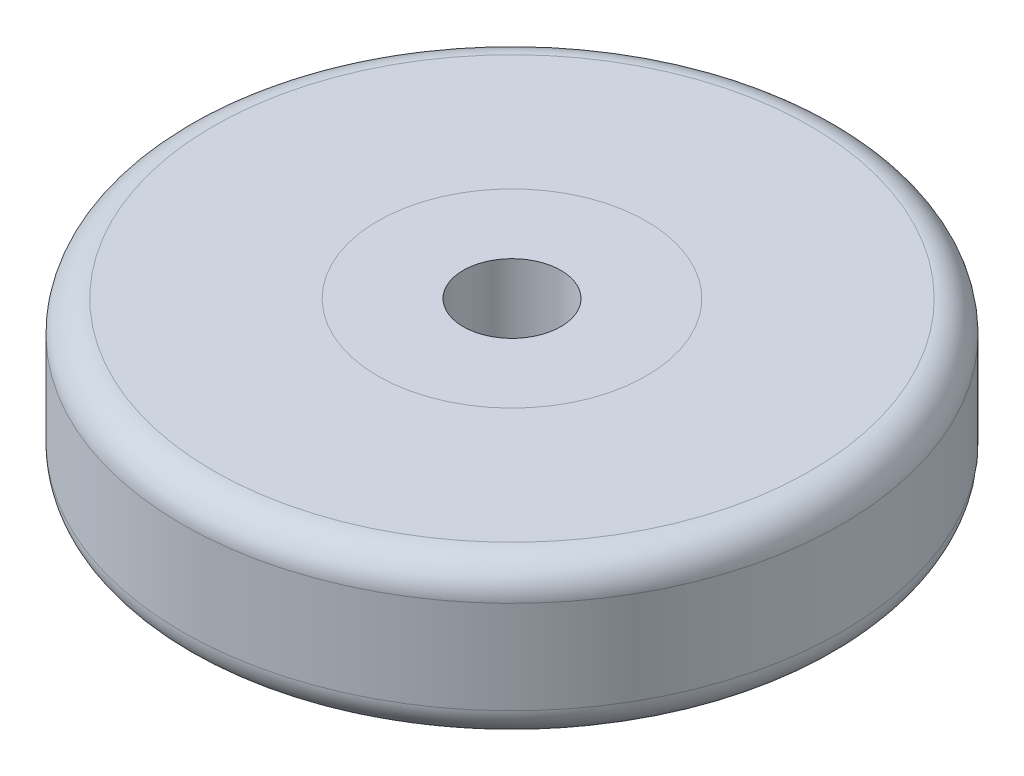
ISO-10303-21;
HEADER;
FILE_DESCRIPTION(('STEP AP214'),'2;1');
FILE_NAME('part.step','',(''),(''),'','','');
FILE_SCHEMA(('AUTOMOTIVE_DESIGN { 1 0 10303 214 1 1 1 1 }'));
ENDSEC;
DATA;
#1=APPLICATION_CONTEXT('core data for automotive mechanical design processes');
#2=APPLICATION_PROTOCOL_DEFINITION('international standard','automotive_design',2000,#1);
#3=PRODUCT_CONTEXT('',#1,'mechanical');
#4=PRODUCT('Part','Part','',(#3));
#5=PRODUCT_RELATED_PRODUCT_CATEGORY('part','',(#4));
#6=PRODUCT_DEFINITION_FORMATION('','',#4);
#7=PRODUCT_DEFINITION_CONTEXT('part definition',#1,'design');
#8=PRODUCT_DEFINITION('design','',#6,#7);
#9=PRODUCT_DEFINITION_SHAPE('','',#8);
#10=(LENGTH_UNIT() NAMED_UNIT(*) SI_UNIT(.MILLI.,.METRE.));
#11=(NAMED_UNIT(*) PLANE_ANGLE_UNIT() SI_UNIT($,.RADIAN.));
#12=(NAMED_UNIT(*) SI_UNIT($,.STERADIAN.) SOLID_ANGLE_UNIT());
#13=UNCERTAINTY_MEASURE_WITH_UNIT(LENGTH_MEASURE(1.E-05),#10,'distance_accuracy_value','');
#14=(GEOMETRIC_REPRESENTATION_CONTEXT(3) GLOBAL_UNCERTAINTY_ASSIGNED_CONTEXT((#13)) GLOBAL_UNIT_ASSIGNED_CONTEXT((#10,
#11,#12)) REPRESENTATION_CONTEXT('',''));
#15=CARTESIAN_POINT('',(0.,0.,0.));
#16=DIRECTION('',(0.,0.,1.));
#17=DIRECTION('',(1.,0.,0.));
#18=AXIS2_PLACEMENT_3D('',#15,#16,#17);
#19=CARTESIAN_POINT('',(0.,0.,0.));
#20=DIRECTION('',(0.,1.,0.));
#21=DIRECTION('',(0.,0.,1.));
#22=AXIS2_PLACEMENT_3D('',#19,#20,#21);
#23=CYLINDRICAL_SURFACE('',#22,27.);
#24=CARTESIAN_POINT('',(0.,2.54,0.));
#25=DIRECTION('',(0.,1.,0.));
#26=DIRECTION('',(0.,0.,1.));
#27=AXIS2_PLACEMENT_3D('',#24,#25,#26);
#28=CIRCLE('',#27,27.);
#29=CARTESIAN_POINT('',(0.,2.54,27.));
#30=VERTEX_POINT('',#29);
#31=EDGE_CURVE('E50',#30,#30,#28,.T.);
#32=ORIENTED_EDGE('',*,*,#31,.T.);
#33=EDGE_LOOP('',(#32));
#34=FACE_BOUND('',#33,.T.);
#35=CARTESIAN_POINT('',(0.,10.16,0.));
#36=DIRECTION('',(0.,1.,0.));
#37=DIRECTION('',(0.,0.,1.));
#38=AXIS2_PLACEMENT_3D('',#35,#36,#37);
#39=CIRCLE('',#38,27.);
#40=CARTESIAN_POINT('',(0.,10.16,27.));
#41=VERTEX_POINT('',#40);
#42=EDGE_CURVE('E54',#41,#41,#39,.F.);
#43=ORIENTED_EDGE('',*,*,#42,.T.);
#44=EDGE_LOOP('',(#43));
#45=FACE_BOUND('',#44,.T.);
#46=ADVANCED_FACE('F39',(#34,#45),#23,.T.);
#47=CARTESIAN_POINT('',(0.,0.,0.));
#48=DIRECTION('',(0.,1.,0.));
#49=DIRECTION('',(0.,0.,1.));
#50=AXIS2_PLACEMENT_3D('',#47,#48,#49);
#51=PLANE('',#50);
#52=CARTESIAN_POINT('',(0.,0.,0.));
#53=DIRECTION('',(0.,1.,0.));
#54=DIRECTION('',(0.,0.,1.));
#55=AXIS2_PLACEMENT_3D('',#52,#53,#54);
#56=CIRCLE('',#55,24.46);
#57=CARTESIAN_POINT('',(0.,0.,24.46));
#58=VERTEX_POINT('',#57);
#59=EDGE_CURVE('E46',#58,#58,#56,.F.);
#60=ORIENTED_EDGE('',*,*,#59,.T.);
#61=EDGE_LOOP('',(#60));
#62=FACE_BOUND('',#61,.T.);
#63=CARTESIAN_POINT('',(0.,0.,0.));
#64=DIRECTION('',(0.,1.,0.));
#65=DIRECTION('',(0.,0.,1.));
#66=AXIS2_PLACEMENT_3D('',#63,#64,#65);
#67=CIRCLE('',#66,11.);
#68=CARTESIAN_POINT('',(0.,0.,11.));
#69=VERTEX_POINT('',#68);
#70=EDGE_CURVE('E59',#69,#69,#67,.T.);
#71=ORIENTED_EDGE('',*,*,#70,.T.);
#72=EDGE_LOOP('',(#71));
#73=FACE_BOUND('',#72,.T.);
#74=ADVANCED_FACE('F66',(#62,#73),#51,.F.);
#75=CARTESIAN_POINT('',(0.,12.7,0.));
#76=DIRECTION('',(0.,1.,0.));
#77=DIRECTION('',(0.,0.,1.));
#78=AXIS2_PLACEMENT_3D('',#75,#76,#77);
#79=PLANE('',#78);
#80=CARTESIAN_POINT('',(0.,12.7,0.));
#81=DIRECTION('',(0.,1.,0.));
#82=DIRECTION('',(0.,0.,1.));
#83=AXIS2_PLACEMENT_3D('',#80,#81,#82);
#84=CIRCLE('',#83,24.46);
#85=CARTESIAN_POINT('',(0.,12.7,24.46));
#86=VERTEX_POINT('',#85);
#87=EDGE_CURVE('E11',#86,#86,#84,.T.);
#88=ORIENTED_EDGE('',*,*,#87,.T.);
#89=EDGE_LOOP('',(#88));
#90=FACE_BOUND('',#89,.T.);
#91=CARTESIAN_POINT('',(0.,12.7,0.));
#92=DIRECTION('',(0.,1.,0.));
#93=DIRECTION('',(0.,0.,1.));
#94=AXIS2_PLACEMENT_3D('',#91,#92,#93);
#95=CIRCLE('',#94,11.);
#96=CARTESIAN_POINT('',(0.,12.7,11.));
#97=VERTEX_POINT('',#96);
#98=EDGE_CURVE('E60',#97,#97,#95,.T.);
#99=ORIENTED_EDGE('',*,*,#98,.F.);
#100=EDGE_LOOP('',(#99));
#101=FACE_BOUND('',#100,.T.);
#102=ADVANCED_FACE('F72',(#90,#101),#79,.T.);
#103=CARTESIAN_POINT('',(0.,0.,0.));
#104=DIRECTION('',(0.,1.,0.));
#105=DIRECTION('',(0.,0.,1.));
#106=AXIS2_PLACEMENT_3D('',#103,#104,#105);
#107=CYLINDRICAL_SURFACE('',#106,11.);
#108=ORIENTED_EDGE('',*,*,#70,.F.);
#109=EDGE_LOOP('',(#108));
#110=FACE_BOUND('',#109,.T.);
#111=ORIENTED_EDGE('',*,*,#98,.T.);
#112=EDGE_LOOP('',(#111));
#113=FACE_BOUND('',#112,.T.);
#114=ADVANCED_FACE('F68',(#110,#113),#107,.F.);
#115=CARTESIAN_POINT('',(0.,2.54,0.));
#116=DIRECTION('',(0.,1.,0.));
#117=DIRECTION('',(0.,0.,1.));
#118=AXIS2_PLACEMENT_3D('',#115,#116,#117);
#119=TOROIDAL_SURFACE('',#118,24.46,2.54);
#120=ORIENTED_EDGE('',*,*,#59,.F.);
#121=EDGE_LOOP('',(#120));
#122=FACE_BOUND('',#121,.T.);
#123=ORIENTED_EDGE('',*,*,#31,.F.);
#124=EDGE_LOOP('',(#123));
#125=FACE_BOUND('',#124,.T.);
#126=ADVANCED_FACE('F71',(#122,#125),#119,.T.);
#127=CARTESIAN_POINT('',(0.,10.16,0.));
#128=DIRECTION('',(0.,1.,0.));
#129=DIRECTION('',(0.,0.,1.));
#130=AXIS2_PLACEMENT_3D('',#127,#128,#129);
#131=TOROIDAL_SURFACE('',#130,24.46,2.54);
#132=ORIENTED_EDGE('',*,*,#42,.F.);
#133=EDGE_LOOP('',(#132));
#134=FACE_BOUND('',#133,.T.);
#135=ORIENTED_EDGE('',*,*,#87,.F.);
#136=EDGE_LOOP('',(#135));
#137=FACE_BOUND('',#136,.T.);
#138=ADVANCED_FACE('F41',(#134,#137),#131,.T.);
#139=CLOSED_SHELL('',(#46,#74,#102,#114,#126,#138));
#140=MANIFOLD_SOLID_BREP('B2',#139);
#141=CARTESIAN_POINT('',(0.,12.7,0.));
#142=DIRECTION('',(0.,1.,0.));
#143=DIRECTION('',(0.,0.,1.));
#144=AXIS2_PLACEMENT_3D('',#141,#142,#143);
#145=PLANE('',#144);
#146=CARTESIAN_POINT('',(0.,12.7,0.));
#147=DIRECTION('',(0.,1.,0.));
#148=DIRECTION('',(0.,0.,1.));
#149=AXIS2_PLACEMENT_3D('',#146,#147,#148);
#150=CIRCLE('',#149,11.);
#151=CARTESIAN_POINT('',(0.,12.7,11.));
#152=VERTEX_POINT('',#151);
#153=EDGE_CURVE('E38',#152,#152,#150,.T.);
#154=ORIENTED_EDGE('',*,*,#153,.T.);
#155=EDGE_LOOP('',(#154));
#156=FACE_BOUND('',#155,.T.);
#157=CARTESIAN_POINT('',(0.,12.7,0.));
#158=DIRECTION('',(0.,1.,0.));
#159=DIRECTION('',(0.,0.,1.));
#160=AXIS2_PLACEMENT_3D('',#157,#158,#159);
#161=CIRCLE('',#160,4.);
#162=CARTESIAN_POINT('',(0.,12.7,4.));
#163=VERTEX_POINT('',#162);
#164=EDGE_CURVE('E142',#163,#163,#161,.T.);
#165=ORIENTED_EDGE('',*,*,#164,.F.);
#166=EDGE_LOOP('',(#165));
#167=FACE_BOUND('',#166,.T.);
#168=ADVANCED_FACE('F131',(#156,#167),#145,.T.);
#169=CARTESIAN_POINT('',(0.,0.,0.));
#170=DIRECTION('',(0.,1.,0.));
#171=DIRECTION('',(0.,0.,1.));
#172=AXIS2_PLACEMENT_3D('',#169,#170,#171);
#173=PLANE('',#172);
#174=CARTESIAN_POINT('',(0.,0.,0.));
#175=DIRECTION('',(0.,1.,0.));
#176=DIRECTION('',(0.,0.,1.));
#177=AXIS2_PLACEMENT_3D('',#174,#175,#176);
#178=CIRCLE('',#177,11.);
#179=CARTESIAN_POINT('',(0.,0.,11.));
#180=VERTEX_POINT('',#179);
#181=EDGE_CURVE('E135',#180,#180,#178,.T.);
#182=ORIENTED_EDGE('',*,*,#181,.F.);
#183=EDGE_LOOP('',(#182));
#184=FACE_BOUND('',#183,.T.);
#185=CARTESIAN_POINT('',(0.,0.,0.));
#186=DIRECTION('',(0.,1.,0.));
#187=DIRECTION('',(0.,0.,1.));
#188=AXIS2_PLACEMENT_3D('',#185,#186,#187);
#189=CIRCLE('',#188,4.);
#190=CARTESIAN_POINT('',(0.,0.,4.));
#191=VERTEX_POINT('',#190);
#192=EDGE_CURVE('E144',#191,#191,#189,.T.);
#193=ORIENTED_EDGE('',*,*,#192,.T.);
#194=EDGE_LOOP('',(#193));
#195=FACE_BOUND('',#194,.T.);
#196=ADVANCED_FACE('F154',(#184,#195),#173,.F.);
#197=CARTESIAN_POINT('',(0.,12.7,0.));
#198=DIRECTION('',(0.,-1.,0.));
#199=DIRECTION('',(0.,0.,-1.));
#200=AXIS2_PLACEMENT_3D('',#197,#198,#199);
#201=CYLINDRICAL_SURFACE('',#200,11.);
#202=ORIENTED_EDGE('',*,*,#153,.F.);
#203=EDGE_LOOP('',(#202));
#204=FACE_BOUND('',#203,.T.);
#205=ORIENTED_EDGE('',*,*,#181,.T.);
#206=EDGE_LOOP('',(#205));
#207=FACE_BOUND('',#206,.T.);
#208=ADVANCED_FACE('F133',(#204,#207),#201,.T.);
#209=CARTESIAN_POINT('',(0.,12.7,0.));
#210=DIRECTION('',(0.,-1.,0.));
#211=DIRECTION('',(0.,0.,-1.));
#212=AXIS2_PLACEMENT_3D('',#209,#210,#211);
#213=CYLINDRICAL_SURFACE('',#212,4.);
#214=ORIENTED_EDGE('',*,*,#164,.T.);
#215=EDGE_LOOP('',(#214));
#216=FACE_BOUND('',#215,.T.);
#217=ORIENTED_EDGE('',*,*,#192,.F.);
#218=EDGE_LOOP('',(#217));
#219=FACE_BOUND('',#218,.T.);
#220=ADVANCED_FACE('F150',(#216,#219),#213,.F.);
#221=CLOSED_SHELL('',(#168,#196,#208,#220));
#222=MANIFOLD_SOLID_BREP('B6',#221);
#223=ADVANCED_BREP_SHAPE_REPRESENTATION('',(#18,#140,#222),#14);
#224=SHAPE_DEFINITION_REPRESENTATION(#9,#223);
ENDSEC;
END-ISO-10303-21;
